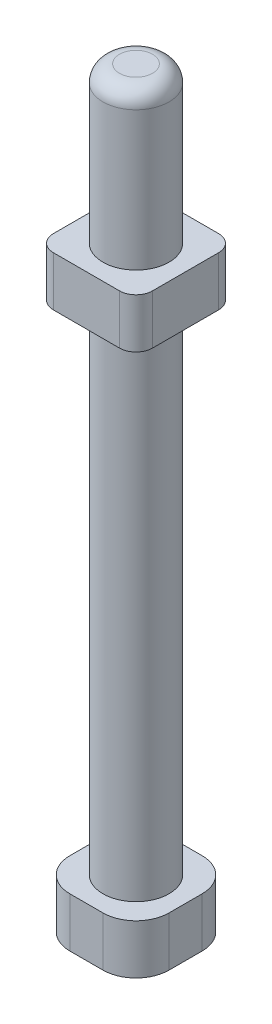
ISO-10303-21;
HEADER;
FILE_DESCRIPTION(('STEP AP214'),'2;1');
FILE_NAME('part.step','',(''),(''),'','','');
FILE_SCHEMA(('AUTOMOTIVE_DESIGN { 1 0 10303 214 1 1 1 1 }'));
ENDSEC;
DATA;
#1=APPLICATION_CONTEXT('core data for automotive mechanical design processes');
#2=APPLICATION_PROTOCOL_DEFINITION('international standard','automotive_design',2000,#1);
#3=PRODUCT_CONTEXT('',#1,'mechanical');
#4=PRODUCT('Part','Part','',(#3));
#5=PRODUCT_RELATED_PRODUCT_CATEGORY('part','',(#4));
#6=PRODUCT_DEFINITION_FORMATION('','',#4);
#7=PRODUCT_DEFINITION_CONTEXT('part definition',#1,'design');
#8=PRODUCT_DEFINITION('design','',#6,#7);
#9=PRODUCT_DEFINITION_SHAPE('','',#8);
#10=(LENGTH_UNIT() NAMED_UNIT(*) SI_UNIT(.MILLI.,.METRE.));
#11=(NAMED_UNIT(*) PLANE_ANGLE_UNIT() SI_UNIT($,.RADIAN.));
#12=(NAMED_UNIT(*) SI_UNIT($,.STERADIAN.) SOLID_ANGLE_UNIT());
#13=UNCERTAINTY_MEASURE_WITH_UNIT(LENGTH_MEASURE(1.E-05),#10,'distance_accuracy_value','');
#14=(GEOMETRIC_REPRESENTATION_CONTEXT(3) GLOBAL_UNCERTAINTY_ASSIGNED_CONTEXT((#13)) GLOBAL_UNIT_ASSIGNED_CONTEXT((#10,
#11,#12)) REPRESENTATION_CONTEXT('',''));
#15=CARTESIAN_POINT('',(0.,0.,0.));
#16=DIRECTION('',(0.,0.,1.));
#17=DIRECTION('',(1.,0.,0.));
#18=AXIS2_PLACEMENT_3D('',#15,#16,#17);
#19=CARTESIAN_POINT('',(3.,3.,-3.));
#20=DIRECTION('',(-1.,0.,0.));
#21=DIRECTION('',(0.,0.,1.));
#22=AXIS2_PLACEMENT_3D('',#19,#20,#21);
#23=PLANE('',#22);
#24=DIRECTION('',(0.,0.,-1.));
#25=VECTOR('',#24,1.);
#26=CARTESIAN_POINT('',(3.,0.,-3.));
#27=LINE('',#26,#25);
#28=CARTESIAN_POINT('',(3.,0.,1.));
#29=VERTEX_POINT('',#28);
#30=CARTESIAN_POINT('',(3.,0.,-1.));
#31=VERTEX_POINT('',#30);
#32=EDGE_CURVE('E194',#29,#31,#27,.T.);
#33=ORIENTED_EDGE('',*,*,#32,.T.);
#34=DIRECTION('',(0.,-1.,0.));
#35=VECTOR('',#34,1.);
#36=CARTESIAN_POINT('',(3.,3.,-1.));
#37=LINE('',#36,#35);
#38=CARTESIAN_POINT('',(3.,3.,-1.));
#39=VERTEX_POINT('',#38);
#40=EDGE_CURVE('E229',#31,#39,#37,.F.);
#41=ORIENTED_EDGE('',*,*,#40,.T.);
#42=DIRECTION('',(0.,0.,-1.));
#43=VECTOR('',#42,1.);
#44=CARTESIAN_POINT('',(3.,3.,-3.));
#45=LINE('',#44,#43);
#46=CARTESIAN_POINT('',(3.,3.,1.));
#47=VERTEX_POINT('',#46);
#48=EDGE_CURVE('E192',#47,#39,#45,.T.);
#49=ORIENTED_EDGE('',*,*,#48,.F.);
#50=DIRECTION('',(0.,-1.,0.));
#51=VECTOR('',#50,1.);
#52=CARTESIAN_POINT('',(3.,3.,1.));
#53=LINE('',#52,#51);
#54=EDGE_CURVE('E225',#47,#29,#53,.T.);
#55=ORIENTED_EDGE('',*,*,#54,.T.);
#56=EDGE_LOOP('',(#33,#41,#49,#55));
#57=FACE_BOUND('',#56,.T.);
#58=ADVANCED_FACE('F41',(#57),#23,.F.);
#59=CARTESIAN_POINT('',(-3.,3.,-3.));
#60=DIRECTION('',(0.,0.,1.));
#61=DIRECTION('',(1.,0.,0.));
#62=AXIS2_PLACEMENT_3D('',#59,#60,#61);
#63=PLANE('',#62);
#64=DIRECTION('',(-1.,0.,0.));
#65=VECTOR('',#64,1.);
#66=CARTESIAN_POINT('',(-3.,0.,-3.));
#67=LINE('',#66,#65);
#68=CARTESIAN_POINT('',(1.,0.,-3.));
#69=VERTEX_POINT('',#68);
#70=CARTESIAN_POINT('',(-1.,0.,-3.));
#71=VERTEX_POINT('',#70);
#72=EDGE_CURVE('E187',#69,#71,#67,.T.);
#73=ORIENTED_EDGE('',*,*,#72,.T.);
#74=DIRECTION('',(0.,-1.,0.));
#75=VECTOR('',#74,1.);
#76=CARTESIAN_POINT('',(-1.,3.,-3.));
#77=LINE('',#76,#75);
#78=CARTESIAN_POINT('',(-1.,3.,-3.));
#79=VERTEX_POINT('',#78);
#80=EDGE_CURVE('E162',#71,#79,#77,.F.);
#81=ORIENTED_EDGE('',*,*,#80,.T.);
#82=DIRECTION('',(-1.,0.,0.));
#83=VECTOR('',#82,1.);
#84=CARTESIAN_POINT('',(-3.,3.,-3.));
#85=LINE('',#84,#83);
#86=CARTESIAN_POINT('',(1.,3.,-3.));
#87=VERTEX_POINT('',#86);
#88=EDGE_CURVE('E343',#87,#79,#85,.T.);
#89=ORIENTED_EDGE('',*,*,#88,.F.);
#90=DIRECTION('',(0.,-1.,0.));
#91=VECTOR('',#90,1.);
#92=CARTESIAN_POINT('',(1.,3.,-3.));
#93=LINE('',#92,#91);
#94=EDGE_CURVE('E168',#87,#69,#93,.T.);
#95=ORIENTED_EDGE('',*,*,#94,.T.);
#96=EDGE_LOOP('',(#73,#81,#89,#95));
#97=FACE_BOUND('',#96,.T.);
#98=ADVANCED_FACE('F366',(#97),#63,.F.);
#99=CARTESIAN_POINT('',(-3.,3.,-3.));
#100=DIRECTION('',(1.,0.,0.));
#101=DIRECTION('',(0.,0.,-1.));
#102=AXIS2_PLACEMENT_3D('',#99,#100,#101);
#103=PLANE('',#102);
#104=DIRECTION('',(0.,0.,1.));
#105=VECTOR('',#104,1.);
#106=CARTESIAN_POINT('',(-3.,3.,-3.));
#107=LINE('',#106,#105);
#108=CARTESIAN_POINT('',(-3.,3.,-1.));
#109=VERTEX_POINT('',#108);
#110=CARTESIAN_POINT('',(-3.,3.,1.));
#111=VERTEX_POINT('',#110);
#112=EDGE_CURVE('E178',#109,#111,#107,.T.);
#113=ORIENTED_EDGE('',*,*,#112,.F.);
#114=DIRECTION('',(0.,-1.,0.));
#115=VECTOR('',#114,1.);
#116=CARTESIAN_POINT('',(-3.,3.,-1.));
#117=LINE('',#116,#115);
#118=CARTESIAN_POINT('',(-3.,0.,-1.));
#119=VERTEX_POINT('',#118);
#120=EDGE_CURVE('E161',#109,#119,#117,.T.);
#121=ORIENTED_EDGE('',*,*,#120,.T.);
#122=DIRECTION('',(0.,0.,1.));
#123=VECTOR('',#122,1.);
#124=CARTESIAN_POINT('',(-3.,0.,-3.));
#125=LINE('',#124,#123);
#126=CARTESIAN_POINT('',(-3.,0.,1.));
#127=VERTEX_POINT('',#126);
#128=EDGE_CURVE('E175',#119,#127,#125,.T.);
#129=ORIENTED_EDGE('',*,*,#128,.T.);
#130=DIRECTION('',(0.,-1.,0.));
#131=VECTOR('',#130,1.);
#132=CARTESIAN_POINT('',(-3.,3.,1.));
#133=LINE('',#132,#131);
#134=EDGE_CURVE('E181',#127,#111,#133,.F.);
#135=ORIENTED_EDGE('',*,*,#134,.T.);
#136=EDGE_LOOP('',(#113,#121,#129,#135));
#137=FACE_BOUND('',#136,.T.);
#138=ADVANCED_FACE('F174',(#137),#103,.F.);
#139=CARTESIAN_POINT('',(-3.,3.,3.));
#140=DIRECTION('',(0.,0.,-1.));
#141=DIRECTION('',(-1.,0.,0.));
#142=AXIS2_PLACEMENT_3D('',#139,#140,#141);
#143=PLANE('',#142);
#144=DIRECTION('',(1.,0.,0.));
#145=VECTOR('',#144,1.);
#146=CARTESIAN_POINT('',(-3.,0.,3.));
#147=LINE('',#146,#145);
#148=CARTESIAN_POINT('',(-1.,0.,3.));
#149=VERTEX_POINT('',#148);
#150=CARTESIAN_POINT('',(1.,0.,3.));
#151=VERTEX_POINT('',#150);
#152=EDGE_CURVE('E186',#149,#151,#147,.T.);
#153=ORIENTED_EDGE('',*,*,#152,.T.);
#154=DIRECTION('',(0.,-1.,0.));
#155=VECTOR('',#154,1.);
#156=CARTESIAN_POINT('',(1.,3.,3.));
#157=LINE('',#156,#155);
#158=CARTESIAN_POINT('',(1.,3.,3.));
#159=VERTEX_POINT('',#158);
#160=EDGE_CURVE('E236',#151,#159,#157,.F.);
#161=ORIENTED_EDGE('',*,*,#160,.T.);
#162=DIRECTION('',(1.,0.,0.));
#163=VECTOR('',#162,1.);
#164=CARTESIAN_POINT('',(-3.,3.,3.));
#165=LINE('',#164,#163);
#166=CARTESIAN_POINT('',(-1.,3.,3.));
#167=VERTEX_POINT('',#166);
#168=EDGE_CURVE('E199',#167,#159,#165,.T.);
#169=ORIENTED_EDGE('',*,*,#168,.F.);
#170=DIRECTION('',(0.,-1.,0.));
#171=VECTOR('',#170,1.);
#172=CARTESIAN_POINT('',(-1.,3.,3.));
#173=LINE('',#172,#171);
#174=EDGE_CURVE('E232',#167,#149,#173,.T.);
#175=ORIENTED_EDGE('',*,*,#174,.T.);
#176=EDGE_LOOP('',(#153,#161,#169,#175));
#177=FACE_BOUND('',#176,.T.);
#178=ADVANCED_FACE('F373',(#177),#143,.F.);
#179=CARTESIAN_POINT('',(0.,3.,0.));
#180=DIRECTION('',(0.,1.,0.));
#181=DIRECTION('',(0.,0.,1.));
#182=AXIS2_PLACEMENT_3D('',#179,#180,#181);
#183=PLANE('',#182);
#184=CARTESIAN_POINT('',(0.,3.,0.));
#185=DIRECTION('',(0.,1.,0.));
#186=DIRECTION('',(0.,0.,1.));
#187=AXIS2_PLACEMENT_3D('',#184,#185,#186);
#188=CIRCLE('',#187,2.);
#189=CARTESIAN_POINT('',(0.,3.,2.));
#190=VERTEX_POINT('',#189);
#191=EDGE_CURVE('E239',#190,#190,#188,.T.);
#192=ORIENTED_EDGE('',*,*,#191,.F.);
#193=EDGE_LOOP('',(#192));
#194=FACE_BOUND('',#193,.T.);
#195=ORIENTED_EDGE('',*,*,#88,.T.);
#196=CARTESIAN_POINT('',(-1.,3.,-1.));
#197=DIRECTION('',(0.,1.,0.));
#198=DIRECTION('',(0.,0.,1.));
#199=AXIS2_PLACEMENT_3D('',#196,#197,#198);
#200=CIRCLE('',#199,2.);
#201=EDGE_CURVE('E222',#79,#109,#200,.T.);
#202=ORIENTED_EDGE('',*,*,#201,.T.);
#203=ORIENTED_EDGE('',*,*,#112,.T.);
#204=CARTESIAN_POINT('',(-1.,3.,1.));
#205=DIRECTION('',(0.,1.,0.));
#206=DIRECTION('',(0.,0.,1.));
#207=AXIS2_PLACEMENT_3D('',#204,#205,#206);
#208=CIRCLE('',#207,2.);
#209=EDGE_CURVE('E213',#111,#167,#208,.T.);
#210=ORIENTED_EDGE('',*,*,#209,.T.);
#211=ORIENTED_EDGE('',*,*,#168,.T.);
#212=CARTESIAN_POINT('',(1.,3.,1.));
#213=DIRECTION('',(0.,1.,0.));
#214=DIRECTION('',(0.,0.,1.));
#215=AXIS2_PLACEMENT_3D('',#212,#213,#214);
#216=CIRCLE('',#215,2.);
#217=EDGE_CURVE('E216',#159,#47,#216,.T.);
#218=ORIENTED_EDGE('',*,*,#217,.T.);
#219=ORIENTED_EDGE('',*,*,#48,.T.);
#220=CARTESIAN_POINT('',(1.,3.,-1.));
#221=DIRECTION('',(0.,1.,0.));
#222=DIRECTION('',(0.,0.,1.));
#223=AXIS2_PLACEMENT_3D('',#220,#221,#222);
#224=CIRCLE('',#223,2.);
#225=EDGE_CURVE('E219',#39,#87,#224,.T.);
#226=ORIENTED_EDGE('',*,*,#225,.T.);
#227=EDGE_LOOP('',(#195,#202,#203,#210,#211,#218,#219,#226));
#228=FACE_BOUND('',#227,.T.);
#229=ADVANCED_FACE('F364',(#194,#228),#183,.T.);
#230=CARTESIAN_POINT('',(0.,0.,0.));
#231=DIRECTION('',(0.,1.,0.));
#232=DIRECTION('',(0.,0.,1.));
#233=AXIS2_PLACEMENT_3D('',#230,#231,#232);
#234=PLANE('',#233);
#235=ORIENTED_EDGE('',*,*,#128,.F.);
#236=CARTESIAN_POINT('',(-1.,0.,-1.));
#237=DIRECTION('',(0.,1.,0.));
#238=DIRECTION('',(0.,0.,1.));
#239=AXIS2_PLACEMENT_3D('',#236,#237,#238);
#240=CIRCLE('',#239,2.);
#241=EDGE_CURVE('E157',#119,#71,#240,.F.);
#242=ORIENTED_EDGE('',*,*,#241,.T.);
#243=ORIENTED_EDGE('',*,*,#72,.F.);
#244=CARTESIAN_POINT('',(1.,0.,-1.));
#245=DIRECTION('',(0.,1.,0.));
#246=DIRECTION('',(0.,0.,1.));
#247=AXIS2_PLACEMENT_3D('',#244,#245,#246);
#248=CIRCLE('',#247,2.);
#249=EDGE_CURVE('E169',#69,#31,#248,.F.);
#250=ORIENTED_EDGE('',*,*,#249,.T.);
#251=ORIENTED_EDGE('',*,*,#32,.F.);
#252=CARTESIAN_POINT('',(1.,0.,1.));
#253=DIRECTION('',(0.,1.,0.));
#254=DIRECTION('',(0.,0.,1.));
#255=AXIS2_PLACEMENT_3D('',#252,#253,#254);
#256=CIRCLE('',#255,2.);
#257=EDGE_CURVE('E203',#29,#151,#256,.F.);
#258=ORIENTED_EDGE('',*,*,#257,.T.);
#259=ORIENTED_EDGE('',*,*,#152,.F.);
#260=CARTESIAN_POINT('',(-1.,0.,1.));
#261=DIRECTION('',(0.,1.,0.));
#262=DIRECTION('',(0.,0.,1.));
#263=AXIS2_PLACEMENT_3D('',#260,#261,#262);
#264=CIRCLE('',#263,2.);
#265=EDGE_CURVE('E180',#149,#127,#264,.F.);
#266=ORIENTED_EDGE('',*,*,#265,.T.);
#267=EDGE_LOOP('',(#235,#242,#243,#250,#251,#258,#259,#266));
#268=FACE_BOUND('',#267,.T.);
#269=ADVANCED_FACE('F183',(#268),#234,.F.);
#270=CARTESIAN_POINT('',(-1.,3.,-1.));
#271=DIRECTION('',(0.,-1.,0.));
#272=DIRECTION('',(0.,0.,-1.));
#273=AXIS2_PLACEMENT_3D('',#270,#271,#272);
#274=CYLINDRICAL_SURFACE('',#273,2.);
#275=ORIENTED_EDGE('',*,*,#201,.F.);
#276=ORIENTED_EDGE('',*,*,#80,.F.);
#277=ORIENTED_EDGE('',*,*,#241,.F.);
#278=ORIENTED_EDGE('',*,*,#120,.F.);
#279=EDGE_LOOP('',(#275,#276,#277,#278));
#280=FACE_BOUND('',#279,.T.);
#281=ADVANCED_FACE('F160',(#280),#274,.T.);
#282=CARTESIAN_POINT('',(1.,3.,-1.));
#283=DIRECTION('',(0.,-1.,0.));
#284=DIRECTION('',(0.,0.,-1.));
#285=AXIS2_PLACEMENT_3D('',#282,#283,#284);
#286=CYLINDRICAL_SURFACE('',#285,2.);
#287=ORIENTED_EDGE('',*,*,#225,.F.);
#288=ORIENTED_EDGE('',*,*,#40,.F.);
#289=ORIENTED_EDGE('',*,*,#249,.F.);
#290=ORIENTED_EDGE('',*,*,#94,.F.);
#291=EDGE_LOOP('',(#287,#288,#289,#290));
#292=FACE_BOUND('',#291,.T.);
#293=ADVANCED_FACE('F360',(#292),#286,.T.);
#294=CARTESIAN_POINT('',(1.,3.,1.));
#295=DIRECTION('',(0.,-1.,0.));
#296=DIRECTION('',(0.,0.,-1.));
#297=AXIS2_PLACEMENT_3D('',#294,#295,#296);
#298=CYLINDRICAL_SURFACE('',#297,2.);
#299=ORIENTED_EDGE('',*,*,#217,.F.);
#300=ORIENTED_EDGE('',*,*,#160,.F.);
#301=ORIENTED_EDGE('',*,*,#257,.F.);
#302=ORIENTED_EDGE('',*,*,#54,.F.);
#303=EDGE_LOOP('',(#299,#300,#301,#302));
#304=FACE_BOUND('',#303,.T.);
#305=ADVANCED_FACE('F382',(#304),#298,.T.);
#306=CARTESIAN_POINT('',(-1.,3.,1.));
#307=DIRECTION('',(0.,-1.,0.));
#308=DIRECTION('',(0.,0.,-1.));
#309=AXIS2_PLACEMENT_3D('',#306,#307,#308);
#310=CYLINDRICAL_SURFACE('',#309,2.);
#311=ORIENTED_EDGE('',*,*,#209,.F.);
#312=ORIENTED_EDGE('',*,*,#134,.F.);
#313=ORIENTED_EDGE('',*,*,#265,.F.);
#314=ORIENTED_EDGE('',*,*,#174,.F.);
#315=EDGE_LOOP('',(#311,#312,#313,#314));
#316=FACE_BOUND('',#315,.T.);
#317=ADVANCED_FACE('F385',(#316),#310,.T.);
#318=CARTESIAN_POINT('',(0.,45.5,0.));
#319=DIRECTION('',(0.,-1.,0.));
#320=DIRECTION('',(0.,0.,-1.));
#321=AXIS2_PLACEMENT_3D('',#318,#319,#320);
#322=CYLINDRICAL_SURFACE('',#321,2.);
#323=CARTESIAN_POINT('',(0.,33.1,0.));
#324=DIRECTION('',(0.,-1.,0.));
#325=DIRECTION('',(0.,0.,-1.));
#326=AXIS2_PLACEMENT_3D('',#323,#324,#325);
#327=CIRCLE('',#326,2.);
#328=CARTESIAN_POINT('',(0.,33.1,-2.));
#329=VERTEX_POINT('',#328);
#330=EDGE_CURVE('E253',#329,#329,#327,.T.);
#331=ORIENTED_EDGE('',*,*,#330,.T.);
#332=EDGE_LOOP('',(#331));
#333=FACE_BOUND('',#332,.T.);
#334=ORIENTED_EDGE('',*,*,#191,.T.);
#335=EDGE_LOOP('',(#334));
#336=FACE_BOUND('',#335,.T.);
#337=ADVANCED_FACE('F389',(#333,#336),#322,.T.);
#338=CARTESIAN_POINT('',(-3.,33.1,-3.));
#339=DIRECTION('',(-1.,0.,0.));
#340=DIRECTION('',(0.,0.,1.));
#341=AXIS2_PLACEMENT_3D('',#338,#339,#340);
#342=PLANE('',#341);
#343=DIRECTION('',(0.,0.,1.));
#344=VECTOR('',#343,1.);
#345=CARTESIAN_POINT('',(-3.,33.1,-3.));
#346=LINE('',#345,#344);
#347=CARTESIAN_POINT('',(-3.,33.1,-2.));
#348=VERTEX_POINT('',#347);
#349=CARTESIAN_POINT('',(-3.,33.1,2.));
#350=VERTEX_POINT('',#349);
#351=EDGE_CURVE('E306',#348,#350,#346,.T.);
#352=ORIENTED_EDGE('',*,*,#351,.T.);
#353=DIRECTION('',(0.,1.,0.));
#354=VECTOR('',#353,1.);
#355=CARTESIAN_POINT('',(-3.,33.1,2.));
#356=LINE('',#355,#354);
#357=CARTESIAN_POINT('',(-3.,36.1,2.));
#358=VERTEX_POINT('',#357);
#359=EDGE_CURVE('E11',#350,#358,#356,.T.);
#360=ORIENTED_EDGE('',*,*,#359,.T.);
#361=DIRECTION('',(0.,0.,1.));
#362=VECTOR('',#361,1.);
#363=CARTESIAN_POINT('',(-3.,36.1,-3.));
#364=LINE('',#363,#362);
#365=CARTESIAN_POINT('',(-3.,36.1,-2.));
#366=VERTEX_POINT('',#365);
#367=EDGE_CURVE('E309',#366,#358,#364,.T.);
#368=ORIENTED_EDGE('',*,*,#367,.F.);
#369=DIRECTION('',(0.,1.,0.));
#370=VECTOR('',#369,1.);
#371=CARTESIAN_POINT('',(-3.,33.1,-2.));
#372=LINE('',#371,#370);
#373=EDGE_CURVE('E50',#366,#348,#372,.F.);
#374=ORIENTED_EDGE('',*,*,#373,.T.);
#375=EDGE_LOOP('',(#352,#360,#368,#374));
#376=FACE_BOUND('',#375,.T.);
#377=ADVANCED_FACE('F305',(#376),#342,.T.);
#378=CARTESIAN_POINT('',(3.,33.1,-3.));
#379=DIRECTION('',(0.,0.,-1.));
#380=DIRECTION('',(-1.,0.,0.));
#381=AXIS2_PLACEMENT_3D('',#378,#379,#380);
#382=PLANE('',#381);
#383=DIRECTION('',(-1.,0.,0.));
#384=VECTOR('',#383,1.);
#385=CARTESIAN_POINT('',(3.,36.1,-3.));
#386=LINE('',#385,#384);
#387=CARTESIAN_POINT('',(2.,36.1,-3.));
#388=VERTEX_POINT('',#387);
#389=CARTESIAN_POINT('',(-2.,36.1,-3.));
#390=VERTEX_POINT('',#389);
#391=EDGE_CURVE('E318',#388,#390,#386,.T.);
#392=ORIENTED_EDGE('',*,*,#391,.F.);
#393=DIRECTION('',(0.,1.,0.));
#394=VECTOR('',#393,1.);
#395=CARTESIAN_POINT('',(2.,33.1,-3.));
#396=LINE('',#395,#394);
#397=CARTESIAN_POINT('',(2.,33.1,-3.));
#398=VERTEX_POINT('',#397);
#399=EDGE_CURVE('E280',#388,#398,#396,.F.);
#400=ORIENTED_EDGE('',*,*,#399,.T.);
#401=DIRECTION('',(-1.,0.,0.));
#402=VECTOR('',#401,1.);
#403=CARTESIAN_POINT('',(3.,33.1,-3.));
#404=LINE('',#403,#402);
#405=CARTESIAN_POINT('',(-2.,33.1,-3.));
#406=VERTEX_POINT('',#405);
#407=EDGE_CURVE('E257',#398,#406,#404,.T.);
#408=ORIENTED_EDGE('',*,*,#407,.T.);
#409=DIRECTION('',(0.,1.,0.));
#410=VECTOR('',#409,1.);
#411=CARTESIAN_POINT('',(-2.,33.1,-3.));
#412=LINE('',#411,#410);
#413=EDGE_CURVE('E276',#406,#390,#412,.T.);
#414=ORIENTED_EDGE('',*,*,#413,.T.);
#415=EDGE_LOOP('',(#392,#400,#408,#414));
#416=FACE_BOUND('',#415,.T.);
#417=ADVANCED_FACE('F324',(#416),#382,.T.);
#418=CARTESIAN_POINT('',(3.,33.1,-3.));
#419=DIRECTION('',(1.,0.,0.));
#420=DIRECTION('',(0.,0.,-1.));
#421=AXIS2_PLACEMENT_3D('',#418,#419,#420);
#422=PLANE('',#421);
#423=DIRECTION('',(0.,0.,-1.));
#424=VECTOR('',#423,1.);
#425=CARTESIAN_POINT('',(3.,33.1,-3.));
#426=LINE('',#425,#424);
#427=CARTESIAN_POINT('',(3.,33.1,2.));
#428=VERTEX_POINT('',#427);
#429=CARTESIAN_POINT('',(3.,33.1,-2.));
#430=VERTEX_POINT('',#429);
#431=EDGE_CURVE('E417',#428,#430,#426,.T.);
#432=ORIENTED_EDGE('',*,*,#431,.T.);
#433=DIRECTION('',(0.,1.,0.));
#434=VECTOR('',#433,1.);
#435=CARTESIAN_POINT('',(3.,33.1,-2.));
#436=LINE('',#435,#434);
#437=CARTESIAN_POINT('',(3.,36.1,-2.));
#438=VERTEX_POINT('',#437);
#439=EDGE_CURVE('E260',#430,#438,#436,.T.);
#440=ORIENTED_EDGE('',*,*,#439,.T.);
#441=DIRECTION('',(0.,0.,-1.));
#442=VECTOR('',#441,1.);
#443=CARTESIAN_POINT('',(3.,36.1,-3.));
#444=LINE('',#443,#442);
#445=CARTESIAN_POINT('',(3.,36.1,2.));
#446=VERTEX_POINT('',#445);
#447=EDGE_CURVE('E330',#446,#438,#444,.T.);
#448=ORIENTED_EDGE('',*,*,#447,.F.);
#449=DIRECTION('',(0.,1.,0.));
#450=VECTOR('',#449,1.);
#451=CARTESIAN_POINT('',(3.,33.1,2.));
#452=LINE('',#451,#450);
#453=EDGE_CURVE('E252',#446,#428,#452,.F.);
#454=ORIENTED_EDGE('',*,*,#453,.T.);
#455=EDGE_LOOP('',(#432,#440,#448,#454));
#456=FACE_BOUND('',#455,.T.);
#457=ADVANCED_FACE('F427',(#456),#422,.T.);
#458=CARTESIAN_POINT('',(3.,33.1,3.));
#459=DIRECTION('',(0.,0.,1.));
#460=DIRECTION('',(1.,0.,0.));
#461=AXIS2_PLACEMENT_3D('',#458,#459,#460);
#462=PLANE('',#461);
#463=DIRECTION('',(1.,0.,0.));
#464=VECTOR('',#463,1.);
#465=CARTESIAN_POINT('',(3.,33.1,3.));
#466=LINE('',#465,#464);
#467=CARTESIAN_POINT('',(-2.,33.1,3.));
#468=VERTEX_POINT('',#467);
#469=CARTESIAN_POINT('',(2.,33.1,3.));
#470=VERTEX_POINT('',#469);
#471=EDGE_CURVE('E317',#468,#470,#466,.T.);
#472=ORIENTED_EDGE('',*,*,#471,.T.);
#473=DIRECTION('',(0.,1.,0.));
#474=VECTOR('',#473,1.);
#475=CARTESIAN_POINT('',(2.,33.1,3.));
#476=LINE('',#475,#474);
#477=CARTESIAN_POINT('',(2.,36.1,3.));
#478=VERTEX_POINT('',#477);
#479=EDGE_CURVE('E296',#470,#478,#476,.T.);
#480=ORIENTED_EDGE('',*,*,#479,.T.);
#481=DIRECTION('',(1.,0.,0.));
#482=VECTOR('',#481,1.);
#483=CARTESIAN_POINT('',(3.,36.1,3.));
#484=LINE('',#483,#482);
#485=CARTESIAN_POINT('',(-2.,36.1,3.));
#486=VERTEX_POINT('',#485);
#487=EDGE_CURVE('E333',#486,#478,#484,.T.);
#488=ORIENTED_EDGE('',*,*,#487,.F.);
#489=DIRECTION('',(0.,1.,0.));
#490=VECTOR('',#489,1.);
#491=CARTESIAN_POINT('',(-2.,33.1,3.));
#492=LINE('',#491,#490);
#493=EDGE_CURVE('E64',#486,#468,#492,.F.);
#494=ORIENTED_EDGE('',*,*,#493,.T.);
#495=EDGE_LOOP('',(#472,#480,#488,#494));
#496=FACE_BOUND('',#495,.T.);
#497=ADVANCED_FACE('F423',(#496),#462,.T.);
#498=CARTESIAN_POINT('',(0.,33.1,0.));
#499=DIRECTION('',(0.,-1.,0.));
#500=DIRECTION('',(0.,0.,-1.));
#501=AXIS2_PLACEMENT_3D('',#498,#499,#500);
#502=PLANE('',#501);
#503=ORIENTED_EDGE('',*,*,#330,.F.);
#504=EDGE_LOOP('',(#503));
#505=FACE_BOUND('',#504,.T.);
#506=ORIENTED_EDGE('',*,*,#407,.F.);
#507=CARTESIAN_POINT('',(2.,33.1,-2.));
#508=DIRECTION('',(0.,-1.,0.));
#509=DIRECTION('',(0.,0.,-1.));
#510=AXIS2_PLACEMENT_3D('',#507,#508,#509);
#511=CIRCLE('',#510,1.);
#512=EDGE_CURVE('E291',#398,#430,#511,.T.);
#513=ORIENTED_EDGE('',*,*,#512,.T.);
#514=ORIENTED_EDGE('',*,*,#431,.F.);
#515=CARTESIAN_POINT('',(2.,33.1,2.));
#516=DIRECTION('',(0.,-1.,0.));
#517=DIRECTION('',(0.,0.,-1.));
#518=AXIS2_PLACEMENT_3D('',#515,#516,#517);
#519=CIRCLE('',#518,1.);
#520=EDGE_CURVE('E57',#428,#470,#519,.T.);
#521=ORIENTED_EDGE('',*,*,#520,.T.);
#522=ORIENTED_EDGE('',*,*,#471,.F.);
#523=CARTESIAN_POINT('',(-2.,33.1,2.));
#524=DIRECTION('',(0.,-1.,0.));
#525=DIRECTION('',(0.,0.,-1.));
#526=AXIS2_PLACEMENT_3D('',#523,#524,#525);
#527=CIRCLE('',#526,1.);
#528=EDGE_CURVE('E286',#468,#350,#527,.T.);
#529=ORIENTED_EDGE('',*,*,#528,.T.);
#530=ORIENTED_EDGE('',*,*,#351,.F.);
#531=CARTESIAN_POINT('',(-2.,33.1,-2.));
#532=DIRECTION('',(0.,-1.,0.));
#533=DIRECTION('',(0.,0.,-1.));
#534=AXIS2_PLACEMENT_3D('',#531,#532,#533);
#535=CIRCLE('',#534,1.);
#536=EDGE_CURVE('E283',#348,#406,#535,.T.);
#537=ORIENTED_EDGE('',*,*,#536,.T.);
#538=EDGE_LOOP('',(#506,#513,#514,#521,#522,#529,#530,#537));
#539=FACE_BOUND('',#538,.T.);
#540=ADVANCED_FACE('F313',(#505,#539),#502,.T.);
#541=CARTESIAN_POINT('',(0.,36.1,0.));
#542=DIRECTION('',(0.,-1.,0.));
#543=DIRECTION('',(0.,0.,-1.));
#544=AXIS2_PLACEMENT_3D('',#541,#542,#543);
#545=PLANE('',#544);
#546=CARTESIAN_POINT('',(0.,36.1,0.));
#547=DIRECTION('',(0.,-1.,0.));
#548=DIRECTION('',(0.,0.,-1.));
#549=AXIS2_PLACEMENT_3D('',#546,#547,#548);
#550=CIRCLE('',#549,2.);
#551=CARTESIAN_POINT('',(0.,36.1,-2.));
#552=VERTEX_POINT('',#551);
#553=EDGE_CURVE('E248',#552,#552,#550,.T.);
#554=ORIENTED_EDGE('',*,*,#553,.T.);
#555=EDGE_LOOP('',(#554));
#556=FACE_BOUND('',#555,.T.);
#557=ORIENTED_EDGE('',*,*,#447,.T.);
#558=CARTESIAN_POINT('',(2.,36.1,-2.));
#559=DIRECTION('',(0.,-1.,0.));
#560=DIRECTION('',(0.,0.,-1.));
#561=AXIS2_PLACEMENT_3D('',#558,#559,#560);
#562=CIRCLE('',#561,1.);
#563=EDGE_CURVE('E273',#438,#388,#562,.F.);
#564=ORIENTED_EDGE('',*,*,#563,.T.);
#565=ORIENTED_EDGE('',*,*,#391,.T.);
#566=CARTESIAN_POINT('',(-2.,36.1,-2.));
#567=DIRECTION('',(0.,-1.,0.));
#568=DIRECTION('',(0.,0.,-1.));
#569=AXIS2_PLACEMENT_3D('',#566,#567,#568);
#570=CIRCLE('',#569,1.);
#571=EDGE_CURVE('E264',#390,#366,#570,.F.);
#572=ORIENTED_EDGE('',*,*,#571,.T.);
#573=ORIENTED_EDGE('',*,*,#367,.T.);
#574=CARTESIAN_POINT('',(-2.,36.1,2.));
#575=DIRECTION('',(0.,-1.,0.));
#576=DIRECTION('',(0.,0.,-1.));
#577=AXIS2_PLACEMENT_3D('',#574,#575,#576);
#578=CIRCLE('',#577,1.);
#579=EDGE_CURVE('E267',#358,#486,#578,.F.);
#580=ORIENTED_EDGE('',*,*,#579,.T.);
#581=ORIENTED_EDGE('',*,*,#487,.T.);
#582=CARTESIAN_POINT('',(2.,36.1,2.));
#583=DIRECTION('',(0.,-1.,0.));
#584=DIRECTION('',(0.,0.,-1.));
#585=AXIS2_PLACEMENT_3D('',#582,#583,#584);
#586=CIRCLE('',#585,1.);
#587=EDGE_CURVE('E270',#478,#446,#586,.F.);
#588=ORIENTED_EDGE('',*,*,#587,.T.);
#589=EDGE_LOOP('',(#557,#564,#565,#572,#573,#580,#581,#588));
#590=FACE_BOUND('',#589,.T.);
#591=ADVANCED_FACE('F328',(#556,#590),#545,.F.);
#592=CARTESIAN_POINT('',(0.,45.5,0.));
#593=DIRECTION('',(0.,1.,0.));
#594=DIRECTION('',(0.,0.,1.));
#595=AXIS2_PLACEMENT_3D('',#592,#593,#594);
#596=PLANE('',#595);
#597=CARTESIAN_POINT('',(0.,45.5,0.));
#598=DIRECTION('',(0.,1.,0.));
#599=DIRECTION('',(0.,0.,1.));
#600=AXIS2_PLACEMENT_3D('',#597,#598,#599);
#601=CIRCLE('',#600,1.);
#602=CARTESIAN_POINT('',(0.,45.5,1.));
#603=VERTEX_POINT('',#602);
#604=EDGE_CURVE('E240',#603,#603,#601,.T.);
#605=ORIENTED_EDGE('',*,*,#604,.T.);
#606=EDGE_LOOP('',(#605));
#607=FACE_BOUND('',#606,.T.);
#608=ADVANCED_FACE('F395',(#607),#596,.T.);
#609=CARTESIAN_POINT('',(0.,44.5,0.));
#610=DIRECTION('',(0.,1.,0.));
#611=DIRECTION('',(0.,0.,1.));
#612=AXIS2_PLACEMENT_3D('',#609,#610,#611);
#613=DEGENERATE_TOROIDAL_SURFACE('',#612,1.,1.,.T.);
#614=CARTESIAN_POINT('',(0.,44.5,0.));
#615=DIRECTION('',(0.,1.,0.));
#616=DIRECTION('',(0.,0.,1.));
#617=AXIS2_PLACEMENT_3D('',#614,#615,#616);
#618=CIRCLE('',#617,2.);
#619=CARTESIAN_POINT('',(0.,44.5,2.));
#620=VERTEX_POINT('',#619);
#621=EDGE_CURVE('E244',#620,#620,#618,.F.);
#622=ORIENTED_EDGE('',*,*,#621,.F.);
#623=EDGE_LOOP('',(#622));
#624=FACE_BOUND('',#623,.T.);
#625=ORIENTED_EDGE('',*,*,#604,.F.);
#626=EDGE_LOOP('',(#625));
#627=FACE_BOUND('',#626,.T.);
#628=ADVANCED_FACE('F391',(#624,#627),#613,.T.);
#629=ORIENTED_EDGE('',*,*,#621,.T.);
#630=EDGE_LOOP('',(#629));
#631=FACE_BOUND('',#630,.T.);
#632=ORIENTED_EDGE('',*,*,#553,.F.);
#633=EDGE_LOOP('',(#632));
#634=FACE_BOUND('',#633,.T.);
#635=ADVANCED_FACE('F394',(#631,#634),#322,.T.);
#636=CARTESIAN_POINT('',(2.,33.1,-2.));
#637=DIRECTION('',(0.,1.,0.));
#638=DIRECTION('',(0.,0.,1.));
#639=AXIS2_PLACEMENT_3D('',#636,#637,#638);
#640=CYLINDRICAL_SURFACE('',#639,1.);
#641=ORIENTED_EDGE('',*,*,#512,.F.);
#642=ORIENTED_EDGE('',*,*,#399,.F.);
#643=ORIENTED_EDGE('',*,*,#563,.F.);
#644=ORIENTED_EDGE('',*,*,#439,.F.);
#645=EDGE_LOOP('',(#641,#642,#643,#644));
#646=FACE_BOUND('',#645,.T.);
#647=ADVANCED_FACE('F397',(#646),#640,.T.);
#648=CARTESIAN_POINT('',(2.,33.1,2.));
#649=DIRECTION('',(0.,1.,0.));
#650=DIRECTION('',(0.,0.,1.));
#651=AXIS2_PLACEMENT_3D('',#648,#649,#650);
#652=CYLINDRICAL_SURFACE('',#651,1.);
#653=ORIENTED_EDGE('',*,*,#520,.F.);
#654=ORIENTED_EDGE('',*,*,#453,.F.);
#655=ORIENTED_EDGE('',*,*,#587,.F.);
#656=ORIENTED_EDGE('',*,*,#479,.F.);
#657=EDGE_LOOP('',(#653,#654,#655,#656));
#658=FACE_BOUND('',#657,.T.);
#659=ADVANCED_FACE('F400',(#658),#652,.T.);
#660=CARTESIAN_POINT('',(-2.,33.1,2.));
#661=DIRECTION('',(0.,1.,0.));
#662=DIRECTION('',(0.,0.,1.));
#663=AXIS2_PLACEMENT_3D('',#660,#661,#662);
#664=CYLINDRICAL_SURFACE('',#663,1.);
#665=ORIENTED_EDGE('',*,*,#528,.F.);
#666=ORIENTED_EDGE('',*,*,#493,.F.);
#667=ORIENTED_EDGE('',*,*,#579,.F.);
#668=ORIENTED_EDGE('',*,*,#359,.F.);
#669=EDGE_LOOP('',(#665,#666,#667,#668));
#670=FACE_BOUND('',#669,.T.);
#671=ADVANCED_FACE('F403',(#670),#664,.T.);
#672=CARTESIAN_POINT('',(-2.,33.1,-2.));
#673=DIRECTION('',(0.,1.,0.));
#674=DIRECTION('',(0.,0.,1.));
#675=AXIS2_PLACEMENT_3D('',#672,#673,#674);
#676=CYLINDRICAL_SURFACE('',#675,1.);
#677=ORIENTED_EDGE('',*,*,#536,.F.);
#678=ORIENTED_EDGE('',*,*,#373,.F.);
#679=ORIENTED_EDGE('',*,*,#571,.F.);
#680=ORIENTED_EDGE('',*,*,#413,.F.);
#681=EDGE_LOOP('',(#677,#678,#679,#680));
#682=FACE_BOUND('',#681,.T.);
#683=ADVANCED_FACE('F43',(#682),#676,.T.);
#684=CLOSED_SHELL('',(#58,#98,#138,#178,#229,#269,#281,#293,#305,#317,#337,#377,#417,#457,#497,
#540,#591,#608,#628,#635,#647,#659,#671,#683));
#685=MANIFOLD_SOLID_BREP('B2',#684);
#686=ADVANCED_BREP_SHAPE_REPRESENTATION('',(#18,#685),#14);
#687=SHAPE_DEFINITION_REPRESENTATION(#9,#686);
ENDSEC;
END-ISO-10303-21;
